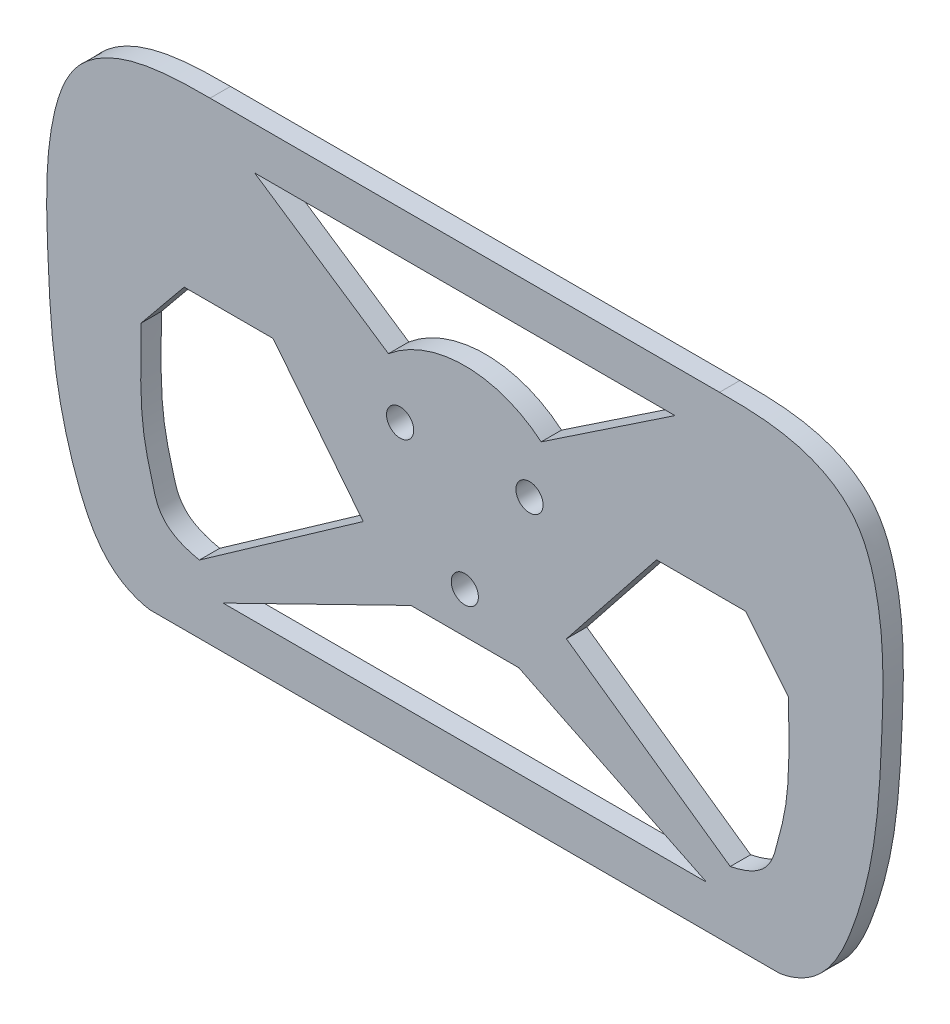
ISO-10303-21;
HEADER;
FILE_DESCRIPTION(('STEP AP214'),'2;1');
FILE_NAME('part.step','',(''),(''),'','','');
FILE_SCHEMA(('AUTOMOTIVE_DESIGN { 1 0 10303 214 1 1 1 1 }'));
ENDSEC;
DATA;
#1=APPLICATION_CONTEXT('core data for automotive mechanical design processes');
#2=APPLICATION_PROTOCOL_DEFINITION('international standard','automotive_design',2000,#1);
#3=PRODUCT_CONTEXT('',#1,'mechanical');
#4=PRODUCT('Part','Part','',(#3));
#5=PRODUCT_RELATED_PRODUCT_CATEGORY('part','',(#4));
#6=PRODUCT_DEFINITION_FORMATION('','',#4);
#7=PRODUCT_DEFINITION_CONTEXT('part definition',#1,'design');
#8=PRODUCT_DEFINITION('design','',#6,#7);
#9=PRODUCT_DEFINITION_SHAPE('','',#8);
#10=(LENGTH_UNIT() NAMED_UNIT(*) SI_UNIT(.MILLI.,.METRE.));
#11=(NAMED_UNIT(*) PLANE_ANGLE_UNIT() SI_UNIT($,.RADIAN.));
#12=(NAMED_UNIT(*) SI_UNIT($,.STERADIAN.) SOLID_ANGLE_UNIT());
#13=UNCERTAINTY_MEASURE_WITH_UNIT(LENGTH_MEASURE(1.E-05),#10,'distance_accuracy_value','');
#14=(GEOMETRIC_REPRESENTATION_CONTEXT(3) GLOBAL_UNCERTAINTY_ASSIGNED_CONTEXT((#13)) GLOBAL_UNIT_ASSIGNED_CONTEXT((#10,
#11,#12)) REPRESENTATION_CONTEXT('',''));
#15=CARTESIAN_POINT('',(0.,0.,0.));
#16=DIRECTION('',(0.,0.,1.));
#17=DIRECTION('',(1.,0.,0.));
#18=AXIS2_PLACEMENT_3D('',#15,#16,#17);
#19=CARTESIAN_POINT('',(0.,65.7259691016847,6.));
#20=DIRECTION('',(0.,1.,0.));
#21=DIRECTION('',(0.,0.,1.));
#22=AXIS2_PLACEMENT_3D('',#19,#20,#21);
#23=PLANE('',#22);
#24=DIRECTION('',(1.,0.,0.));
#25=VECTOR('',#24,1.);
#26=CARTESIAN_POINT('',(0.,65.7259691016847,0.));
#27=LINE('',#26,#25);
#28=CARTESIAN_POINT('',(-75.,65.7259691016847,0.));
#29=VERTEX_POINT('',#28);
#30=CARTESIAN_POINT('',(75.,65.7259691016847,0.));
#31=VERTEX_POINT('',#30);
#32=EDGE_CURVE('E471',#29,#31,#27,.T.);
#33=ORIENTED_EDGE('',*,*,#32,.F.);
#34=DIRECTION('',(0.,0.,-1.));
#35=VECTOR('',#34,1.);
#36=CARTESIAN_POINT('',(-75.,65.7259691016847,6.));
#37=LINE('',#36,#35);
#38=CARTESIAN_POINT('',(-75.,65.7259691016847,6.));
#39=VERTEX_POINT('',#38);
#40=EDGE_CURVE('E11',#39,#29,#37,.T.);
#41=ORIENTED_EDGE('',*,*,#40,.F.);
#42=DIRECTION('',(1.,0.,0.));
#43=VECTOR('',#42,1.);
#44=CARTESIAN_POINT('',(0.,65.7259691016847,6.));
#45=LINE('',#44,#43);
#46=CARTESIAN_POINT('',(75.,65.7259691016847,6.));
#47=VERTEX_POINT('',#46);
#48=EDGE_CURVE('E198',#39,#47,#45,.T.);
#49=ORIENTED_EDGE('',*,*,#48,.T.);
#50=DIRECTION('',(0.,0.,-1.));
#51=VECTOR('',#50,1.);
#52=CARTESIAN_POINT('',(75.,65.7259691016847,6.));
#53=LINE('',#52,#51);
#54=EDGE_CURVE('E54',#47,#31,#53,.T.);
#55=ORIENTED_EDGE('',*,*,#54,.T.);
#56=EDGE_LOOP('',(#33,#41,#49,#55));
#57=FACE_BOUND('',#56,.T.);
#58=ADVANCED_FACE('F35',(#57),#23,.T.);
#59=CARTESIAN_POINT('',(-75.,65.7259691016847,6.));
#60=CARTESIAN_POINT('',(-83.1081901990883,65.7259691016847,6.));
#61=CARTESIAN_POINT('',(-98.0764792531761,65.5654131456338,6.));
#62=CARTESIAN_POINT('',(-116.227458239012,54.9351033241024,6.));
#63=CARTESIAN_POINT('',(-123.782270508209,31.9873900023455,6.));
#64=CARTESIAN_POINT('',(-122.974942530496,4.16927200689115,6.));
#65=CARTESIAN_POINT('',(-121.472955636675,-25.8179218460008,6.));
#66=CARTESIAN_POINT('',(-114.363626194015,-53.8816355469339,6.));
#67=CARTESIAN_POINT('',(-105.22229252136,-71.4115092429265,6.));
#68=CARTESIAN_POINT('',(-92.8418712487192,-73.620070940555,6.));
#69=B_SPLINE_CURVE_WITH_KNOTS('',3,(#59,#60,#61,#62,#63,#64,#65,#66,#67,#68),.UNSPECIFIED.,.F.,
.F.,(4,1,1,1,1,1,1,4),(0.,0.144554348002838,0.228464376945022,0.330263898432636,
0.520750714420918,0.690485280331211,0.822627378586385,1.),.UNSPECIFIED.);
#70=DIRECTION('',(0.,0.,-1.));
#71=VECTOR('',#70,1.);
#72=SURFACE_OF_LINEAR_EXTRUSION('',#69,#71);
#73=CARTESIAN_POINT('',(-75.,65.7259691016847,0.));
#74=CARTESIAN_POINT('',(-83.1081901990883,65.7259691016847,0.));
#75=CARTESIAN_POINT('',(-98.0764792531761,65.5654131456338,0.));
#76=CARTESIAN_POINT('',(-116.227458239012,54.9351033241024,0.));
#77=CARTESIAN_POINT('',(-123.782270508209,31.9873900023455,0.));
#78=CARTESIAN_POINT('',(-122.974942530496,4.16927200689115,0.));
#79=CARTESIAN_POINT('',(-121.472955636675,-25.8179218460008,0.));
#80=CARTESIAN_POINT('',(-114.363626194015,-53.8816355469339,0.));
#81=CARTESIAN_POINT('',(-105.22229252136,-71.4115092429265,0.));
#82=CARTESIAN_POINT('',(-92.8418712487192,-73.620070940555,0.));
#83=B_SPLINE_CURVE_WITH_KNOTS('',3,(#73,#74,#75,#76,#77,#78,#79,#80,#81,#82),.UNSPECIFIED.,.F.,
.F.,(4,1,1,1,1,1,1,4),(0.,0.144554348002838,0.228464376945022,0.330263898432636,
0.520750714420918,0.690485280331211,0.822627378586385,1.),.UNSPECIFIED.);
#84=CARTESIAN_POINT('',(-92.8418712487192,-73.620070940555,0.));
#85=VERTEX_POINT('',#84);
#86=EDGE_CURVE('E204',#29,#85,#83,.T.);
#87=ORIENTED_EDGE('',*,*,#86,.T.);
#88=DIRECTION('',(0.,0.,-1.));
#89=VECTOR('',#88,1.);
#90=CARTESIAN_POINT('',(-92.8418712487192,-73.620070940555,6.));
#91=LINE('',#90,#89);
#92=CARTESIAN_POINT('',(-92.8418712487192,-73.620070940555,6.));
#93=VERTEX_POINT('',#92);
#94=EDGE_CURVE('E45',#93,#85,#91,.T.);
#95=ORIENTED_EDGE('',*,*,#94,.F.);
#96=EDGE_CURVE('E192',#39,#93,#69,.T.);
#97=ORIENTED_EDGE('',*,*,#96,.F.);
#98=ORIENTED_EDGE('',*,*,#40,.T.);
#99=EDGE_LOOP('',(#87,#95,#97,#98));
#100=FACE_BOUND('',#99,.T.);
#101=ADVANCED_FACE('F202',(#100),#72,.F.);
#102=CARTESIAN_POINT('',(0.,-73.620070940555,6.));
#103=DIRECTION('',(0.,-1.,0.));
#104=DIRECTION('',(0.,0.,-1.));
#105=AXIS2_PLACEMENT_3D('',#102,#103,#104);
#106=PLANE('',#105);
#107=DIRECTION('',(-1.,0.,0.));
#108=VECTOR('',#107,1.);
#109=CARTESIAN_POINT('',(0.,-73.620070940555,0.));
#110=LINE('',#109,#108);
#111=CARTESIAN_POINT('',(92.8418712487192,-73.620070940555,0.));
#112=VERTEX_POINT('',#111);
#113=EDGE_CURVE('E339',#112,#85,#110,.T.);
#114=ORIENTED_EDGE('',*,*,#113,.F.);
#115=DIRECTION('',(0.,0.,-1.));
#116=VECTOR('',#115,1.);
#117=CARTESIAN_POINT('',(92.8418712487192,-73.620070940555,6.));
#118=LINE('',#117,#116);
#119=CARTESIAN_POINT('',(92.8418712487192,-73.620070940555,6.));
#120=VERTEX_POINT('',#119);
#121=EDGE_CURVE('E121',#120,#112,#118,.T.);
#122=ORIENTED_EDGE('',*,*,#121,.F.);
#123=DIRECTION('',(-1.,0.,0.));
#124=VECTOR('',#123,1.);
#125=CARTESIAN_POINT('',(0.,-73.620070940555,6.));
#126=LINE('',#125,#124);
#127=EDGE_CURVE('E197',#120,#93,#126,.T.);
#128=ORIENTED_EDGE('',*,*,#127,.T.);
#129=ORIENTED_EDGE('',*,*,#94,.T.);
#130=EDGE_LOOP('',(#114,#122,#128,#129));
#131=FACE_BOUND('',#130,.T.);
#132=ADVANCED_FACE('F208',(#131),#106,.T.);
#133=CARTESIAN_POINT('',(10.3833957913881,-21.2268138470578,6.));
#134=DIRECTION('',(0.439409666933636,-0.898286783051644,0.));
#135=DIRECTION('',(0.898286783051644,0.439409666933636,0.));
#136=AXIS2_PLACEMENT_3D('',#133,#134,#135);
#137=PLANE('',#136);
#138=DIRECTION('',(-0.898286783051644,-0.439409666933636,0.));
#139=VECTOR('',#138,1.);
#140=CARTESIAN_POINT('',(10.3833957913881,-21.2268138470578,0.));
#141=LINE('',#140,#139);
#142=CARTESIAN_POINT('',(-15.8757353781866,-34.0718387309718,0.));
#143=VERTEX_POINT('',#142);
#144=CARTESIAN_POINT('',(-71.1705350313991,-61.120070940555,0.));
#145=VERTEX_POINT('',#144);
#146=EDGE_CURVE('E450',#143,#145,#141,.T.);
#147=ORIENTED_EDGE('',*,*,#146,.F.);
#148=DIRECTION('',(0.,0.,-1.));
#149=VECTOR('',#148,1.);
#150=CARTESIAN_POINT('',(-15.8757353781866,-34.0718387309718,6.));
#151=LINE('',#150,#149);
#152=CARTESIAN_POINT('',(-15.8757353781866,-34.0718387309718,6.));
#153=VERTEX_POINT('',#152);
#154=EDGE_CURVE('E352',#153,#143,#151,.T.);
#155=ORIENTED_EDGE('',*,*,#154,.F.);
#156=DIRECTION('',(-0.898286783051644,-0.439409666933636,0.));
#157=VECTOR('',#156,1.);
#158=CARTESIAN_POINT('',(10.3833957913881,-21.2268138470578,6.));
#159=LINE('',#158,#157);
#160=CARTESIAN_POINT('',(-71.1705350313991,-61.120070940555,6.));
#161=VERTEX_POINT('',#160);
#162=EDGE_CURVE('E316',#153,#161,#159,.T.);
#163=ORIENTED_EDGE('',*,*,#162,.T.);
#164=DIRECTION('',(0.,0.,-1.));
#165=VECTOR('',#164,1.);
#166=CARTESIAN_POINT('',(-71.1705350313991,-61.120070940555,6.));
#167=LINE('',#166,#165);
#168=EDGE_CURVE('E354',#161,#145,#167,.T.);
#169=ORIENTED_EDGE('',*,*,#168,.T.);
#170=EDGE_LOOP('',(#147,#155,#163,#169));
#171=FACE_BOUND('',#170,.T.);
#172=ADVANCED_FACE('F236',(#171),#137,.T.);
#173=CARTESIAN_POINT('',(0.,-34.0718387309718,6.));
#174=DIRECTION('',(0.,1.,0.));
#175=DIRECTION('',(0.,0.,1.));
#176=AXIS2_PLACEMENT_3D('',#173,#174,#175);
#177=PLANE('',#176);
#178=DIRECTION('',(1.,0.,0.));
#179=VECTOR('',#178,1.);
#180=CARTESIAN_POINT('',(0.,-34.0718387309718,0.));
#181=LINE('',#180,#179);
#182=CARTESIAN_POINT('',(15.8757353781866,-34.0718387309718,0.));
#183=VERTEX_POINT('',#182);
#184=EDGE_CURVE('E453',#143,#183,#181,.T.);
#185=ORIENTED_EDGE('',*,*,#184,.T.);
#186=DIRECTION('',(0.,0.,-1.));
#187=VECTOR('',#186,1.);
#188=CARTESIAN_POINT('',(15.8757353781866,-34.0718387309718,6.));
#189=LINE('',#188,#187);
#190=CARTESIAN_POINT('',(15.8757353781866,-34.0718387309718,6.));
#191=VERTEX_POINT('',#190);
#192=EDGE_CURVE('E360',#191,#183,#189,.T.);
#193=ORIENTED_EDGE('',*,*,#192,.F.);
#194=DIRECTION('',(1.,0.,0.));
#195=VECTOR('',#194,1.);
#196=CARTESIAN_POINT('',(0.,-34.0718387309718,6.));
#197=LINE('',#196,#195);
#198=EDGE_CURVE('E319',#153,#191,#197,.T.);
#199=ORIENTED_EDGE('',*,*,#198,.F.);
#200=ORIENTED_EDGE('',*,*,#154,.T.);
#201=EDGE_LOOP('',(#185,#193,#199,#200));
#202=FACE_BOUND('',#201,.T.);
#203=ADVANCED_FACE('F263',(#202),#177,.F.);
#204=CARTESIAN_POINT('',(-10.3833957913881,-21.2268138470578,6.));
#205=DIRECTION('',(0.439409666933636,0.898286783051644,0.));
#206=DIRECTION('',(-0.898286783051644,0.439409666933636,0.));
#207=AXIS2_PLACEMENT_3D('',#204,#205,#206);
#208=PLANE('',#207);
#209=DIRECTION('',(0.898286783051644,-0.439409666933636,0.));
#210=VECTOR('',#209,1.);
#211=CARTESIAN_POINT('',(-10.3833957913881,-21.2268138470578,0.));
#212=LINE('',#211,#210);
#213=CARTESIAN_POINT('',(71.1705350313991,-61.120070940555,0.));
#214=VERTEX_POINT('',#213);
#215=EDGE_CURVE('E456',#183,#214,#212,.T.);
#216=ORIENTED_EDGE('',*,*,#215,.T.);
#217=DIRECTION('',(0.,0.,-1.));
#218=VECTOR('',#217,1.);
#219=CARTESIAN_POINT('',(71.1705350313991,-61.120070940555,6.));
#220=LINE('',#219,#218);
#221=CARTESIAN_POINT('',(71.1705350313991,-61.120070940555,6.));
#222=VERTEX_POINT('',#221);
#223=EDGE_CURVE('E356',#222,#214,#220,.T.);
#224=ORIENTED_EDGE('',*,*,#223,.F.);
#225=DIRECTION('',(0.898286783051644,-0.439409666933636,0.));
#226=VECTOR('',#225,1.);
#227=CARTESIAN_POINT('',(-10.3833957913881,-21.2268138470578,6.));
#228=LINE('',#227,#226);
#229=EDGE_CURVE('E322',#191,#222,#228,.T.);
#230=ORIENTED_EDGE('',*,*,#229,.F.);
#231=ORIENTED_EDGE('',*,*,#192,.T.);
#232=EDGE_LOOP('',(#216,#224,#230,#231));
#233=FACE_BOUND('',#232,.T.);
#234=ADVANCED_FACE('F259',(#233),#208,.F.);
#235=CARTESIAN_POINT('',(-5.43677896468764,8.11448468911986,6.));
#236=DIRECTION('',(-0.556621129897083,0.830766464027102,0.));
#237=DIRECTION('',(-0.830766464027102,-0.556621129897084,0.));
#238=AXIS2_PLACEMENT_3D('',#235,#236,#237);
#239=PLANE('',#238);
#240=DIRECTION('',(0.830766464027102,0.556621129897084,0.));
#241=VECTOR('',#240,1.);
#242=CARTESIAN_POINT('',(-5.43677896468764,8.11448468911986,0.));
#243=LINE('',#242,#241);
#244=CARTESIAN_POINT('',(22.4848428090624,26.82222667587,0.));
#245=VERTEX_POINT('',#244);
#246=CARTESIAN_POINT('',(61.8928755875381,53.2259691016847,0.));
#247=VERTEX_POINT('',#246);
#248=EDGE_CURVE('E435',#245,#247,#243,.T.);
#249=ORIENTED_EDGE('',*,*,#248,.F.);
#250=DIRECTION('',(0.,0.,-1.));
#251=VECTOR('',#250,1.);
#252=CARTESIAN_POINT('',(22.4848428090624,26.82222667587,6.));
#253=LINE('',#252,#251);
#254=CARTESIAN_POINT('',(22.4848428090624,26.82222667587,6.));
#255=VERTEX_POINT('',#254);
#256=EDGE_CURVE('E357',#255,#245,#253,.T.);
#257=ORIENTED_EDGE('',*,*,#256,.F.);
#258=DIRECTION('',(0.830766464027102,0.556621129897084,0.));
#259=VECTOR('',#258,1.);
#260=CARTESIAN_POINT('',(-5.43677896468764,8.11448468911986,6.));
#261=LINE('',#260,#259);
#262=CARTESIAN_POINT('',(61.8928755875381,53.2259691016847,6.));
#263=VERTEX_POINT('',#262);
#264=EDGE_CURVE('E300',#255,#263,#261,.T.);
#265=ORIENTED_EDGE('',*,*,#264,.T.);
#266=DIRECTION('',(0.,0.,-1.));
#267=VECTOR('',#266,1.);
#268=CARTESIAN_POINT('',(61.8928755875381,53.2259691016847,6.));
#269=LINE('',#268,#267);
#270=EDGE_CURVE('E364',#263,#247,#269,.T.);
#271=ORIENTED_EDGE('',*,*,#270,.T.);
#272=EDGE_LOOP('',(#249,#257,#265,#271));
#273=FACE_BOUND('',#272,.T.);
#274=ADVANCED_FACE('F262',(#273),#239,.T.);
#275=CARTESIAN_POINT('',(0.,0.,6.));
#276=DIRECTION('',(0.,0.,-1.));
#277=DIRECTION('',(-1.,0.,0.));
#278=AXIS2_PLACEMENT_3D('',#275,#276,#277);
#279=CYLINDRICAL_SURFACE('',#278,35.);
#280=CARTESIAN_POINT('',(0.,0.,0.));
#281=DIRECTION('',(0.,0.,1.));
#282=DIRECTION('',(1.,0.,0.));
#283=AXIS2_PLACEMENT_3D('',#280,#281,#282);
#284=CIRCLE('',#283,35.);
#285=CARTESIAN_POINT('',(-22.4848428090624,26.82222667587,0.));
#286=VERTEX_POINT('',#285);
#287=EDGE_CURVE('E441',#245,#286,#284,.T.);
#288=ORIENTED_EDGE('',*,*,#287,.T.);
#289=DIRECTION('',(0.,0.,-1.));
#290=VECTOR('',#289,1.);
#291=CARTESIAN_POINT('',(-22.4848428090624,26.82222667587,6.));
#292=LINE('',#291,#290);
#293=CARTESIAN_POINT('',(-22.4848428090624,26.82222667587,6.));
#294=VERTEX_POINT('',#293);
#295=EDGE_CURVE('E369',#294,#286,#292,.T.);
#296=ORIENTED_EDGE('',*,*,#295,.F.);
#297=CARTESIAN_POINT('',(0.,0.,6.));
#298=DIRECTION('',(0.,0.,1.));
#299=DIRECTION('',(1.,0.,0.));
#300=AXIS2_PLACEMENT_3D('',#297,#298,#299);
#301=CIRCLE('',#300,35.);
#302=EDGE_CURVE('E308',#255,#294,#301,.T.);
#303=ORIENTED_EDGE('',*,*,#302,.F.);
#304=ORIENTED_EDGE('',*,*,#256,.T.);
#305=EDGE_LOOP('',(#288,#296,#303,#304));
#306=FACE_BOUND('',#305,.T.);
#307=ADVANCED_FACE('F279',(#306),#279,.T.);
#308=CARTESIAN_POINT('',(5.43677896468764,8.11448468911986,6.));
#309=DIRECTION('',(-0.556621129897083,-0.830766464027102,0.));
#310=DIRECTION('',(0.830766464027102,-0.556621129897084,0.));
#311=AXIS2_PLACEMENT_3D('',#308,#309,#310);
#312=PLANE('',#311);
#313=DIRECTION('',(-0.830766464027102,0.556621129897084,0.));
#314=VECTOR('',#313,1.);
#315=CARTESIAN_POINT('',(5.43677896468764,8.11448468911986,0.));
#316=LINE('',#315,#314);
#317=CARTESIAN_POINT('',(-61.8928755875381,53.2259691016847,0.));
#318=VERTEX_POINT('',#317);
#319=EDGE_CURVE('E444',#286,#318,#316,.T.);
#320=ORIENTED_EDGE('',*,*,#319,.T.);
#321=DIRECTION('',(0.,0.,-1.));
#322=VECTOR('',#321,1.);
#323=CARTESIAN_POINT('',(-61.8928755875381,53.2259691016847,6.));
#324=LINE('',#323,#322);
#325=CARTESIAN_POINT('',(-61.8928755875381,53.2259691016847,6.));
#326=VERTEX_POINT('',#325);
#327=EDGE_CURVE('E366',#326,#318,#324,.T.);
#328=ORIENTED_EDGE('',*,*,#327,.F.);
#329=DIRECTION('',(-0.830766464027102,0.556621129897084,0.));
#330=VECTOR('',#329,1.);
#331=CARTESIAN_POINT('',(5.43677896468764,8.11448468911986,6.));
#332=LINE('',#331,#330);
#333=EDGE_CURVE('E311',#294,#326,#332,.T.);
#334=ORIENTED_EDGE('',*,*,#333,.F.);
#335=ORIENTED_EDGE('',*,*,#295,.T.);
#336=EDGE_LOOP('',(#320,#328,#334,#335));
#337=FACE_BOUND('',#336,.T.);
#338=ADVANCED_FACE('F275',(#337),#312,.F.);
#339=CARTESIAN_POINT('',(-56.303101597978,45.9787952139932,6.));
#340=DIRECTION('',(0.77454608586857,-0.632517478703694,0.));
#341=DIRECTION('',(0.632517478703694,0.77454608586857,0.));
#342=AXIS2_PLACEMENT_3D('',#339,#340,#341);
#343=PLANE('',#342);
#344=DIRECTION('',(-0.632517478703694,-0.77454608586857,0.));
#345=VECTOR('',#344,1.);
#346=CARTESIAN_POINT('',(-56.303101597978,45.9787952139932,0.));
#347=LINE('',#346,#345);
#348=CARTESIAN_POINT('',(-82.6455031804008,13.7213403214278,0.));
#349=VERTEX_POINT('',#348);
#350=CARTESIAN_POINT('',(-95.3562487472723,-1.84353900407075,0.));
#351=VERTEX_POINT('',#350);
#352=EDGE_CURVE('E413',#349,#351,#347,.T.);
#353=ORIENTED_EDGE('',*,*,#352,.F.);
#354=DIRECTION('',(0.,0.,-1.));
#355=VECTOR('',#354,1.);
#356=CARTESIAN_POINT('',(-82.6455031804008,13.7213403214278,6.));
#357=LINE('',#356,#355);
#358=CARTESIAN_POINT('',(-82.6455031804008,13.7213403214278,6.));
#359=VERTEX_POINT('',#358);
#360=EDGE_CURVE('E367',#359,#349,#357,.T.);
#361=ORIENTED_EDGE('',*,*,#360,.F.);
#362=DIRECTION('',(-0.632517478703694,-0.77454608586857,0.));
#363=VECTOR('',#362,1.);
#364=CARTESIAN_POINT('',(-56.303101597978,45.9787952139932,6.));
#365=LINE('',#364,#363);
#366=CARTESIAN_POINT('',(-95.3562487472723,-1.84353900407075,6.));
#367=VERTEX_POINT('',#366);
#368=EDGE_CURVE('E490',#359,#367,#365,.T.);
#369=ORIENTED_EDGE('',*,*,#368,.T.);
#370=DIRECTION('',(0.,0.,-1.));
#371=VECTOR('',#370,1.);
#372=CARTESIAN_POINT('',(-95.3562487472723,-1.84353900407075,6.));
#373=LINE('',#372,#371);
#374=EDGE_CURVE('E373',#367,#351,#373,.T.);
#375=ORIENTED_EDGE('',*,*,#374,.T.);
#376=EDGE_LOOP('',(#353,#361,#369,#375));
#377=FACE_BOUND('',#376,.T.);
#378=ADVANCED_FACE('F278',(#377),#343,.T.);
#379=CARTESIAN_POINT('',(0.,13.7213403214278,6.));
#380=DIRECTION('',(0.,1.,0.));
#381=DIRECTION('',(0.,0.,1.));
#382=AXIS2_PLACEMENT_3D('',#379,#380,#381);
#383=PLANE('',#382);
#384=DIRECTION('',(1.,0.,0.));
#385=VECTOR('',#384,1.);
#386=CARTESIAN_POINT('',(0.,13.7213403214278,0.));
#387=LINE('',#386,#385);
#388=CARTESIAN_POINT('',(-56.4566771112309,13.7213403214278,0.));
#389=VERTEX_POINT('',#388);
#390=EDGE_CURVE('E417',#349,#389,#387,.T.);
#391=ORIENTED_EDGE('',*,*,#390,.T.);
#392=DIRECTION('',(0.,0.,-1.));
#393=VECTOR('',#392,1.);
#394=CARTESIAN_POINT('',(-56.4566771112309,13.7213403214278,6.));
#395=LINE('',#394,#393);
#396=CARTESIAN_POINT('',(-56.4566771112309,13.7213403214278,6.));
#397=VERTEX_POINT('',#396);
#398=EDGE_CURVE('E379',#397,#389,#395,.T.);
#399=ORIENTED_EDGE('',*,*,#398,.F.);
#400=DIRECTION('',(1.,0.,0.));
#401=VECTOR('',#400,1.);
#402=CARTESIAN_POINT('',(0.,13.7213403214278,6.));
#403=LINE('',#402,#401);
#404=EDGE_CURVE('E525',#359,#397,#403,.T.);
#405=ORIENTED_EDGE('',*,*,#404,.F.);
#406=ORIENTED_EDGE('',*,*,#360,.T.);
#407=EDGE_LOOP('',(#391,#399,#405,#406));
#408=FACE_BOUND('',#407,.T.);
#409=ADVANCED_FACE('F543',(#408),#383,.F.);
#410=CARTESIAN_POINT('',(-27.9319950047156,-22.1879110983492,6.));
#411=DIRECTION('',(0.783020448760755,0.621995962062862,0.));
#412=DIRECTION('',(-0.621995962062862,0.783020448760755,0.));
#413=AXIS2_PLACEMENT_3D('',#410,#411,#412);
#414=PLANE('',#413);
#415=DIRECTION('',(0.621995962062862,-0.783020448760755,0.));
#416=VECTOR('',#415,1.);
#417=CARTESIAN_POINT('',(-27.9319950047156,-22.1879110983492,0.));
#418=LINE('',#417,#416);
#419=CARTESIAN_POINT('',(-29.9134074545485,-19.6935436743185,0.));
#420=VERTEX_POINT('',#419);
#421=EDGE_CURVE('E424',#389,#420,#418,.T.);
#422=ORIENTED_EDGE('',*,*,#421,.T.);
#423=DIRECTION('',(0.,0.,-1.));
#424=VECTOR('',#423,1.);
#425=CARTESIAN_POINT('',(-29.9134074545485,-19.6935436743185,6.));
#426=LINE('',#425,#424);
#427=CARTESIAN_POINT('',(-29.9134074545485,-19.6935436743185,6.));
#428=VERTEX_POINT('',#427);
#429=EDGE_CURVE('E377',#428,#420,#426,.T.);
#430=ORIENTED_EDGE('',*,*,#429,.F.);
#431=DIRECTION('',(0.621995962062862,-0.783020448760755,0.));
#432=VECTOR('',#431,1.);
#433=CARTESIAN_POINT('',(-27.9319950047156,-22.1879110983492,6.));
#434=LINE('',#433,#432);
#435=EDGE_CURVE('E530',#397,#428,#434,.T.);
#436=ORIENTED_EDGE('',*,*,#435,.F.);
#437=ORIENTED_EDGE('',*,*,#398,.T.);
#438=EDGE_LOOP('',(#422,#430,#436,#437));
#439=FACE_BOUND('',#438,.T.);
#440=ADVANCED_FACE('F545',(#439),#414,.F.);
#441=CARTESIAN_POINT('',(-0.63517585613574,0.902913806371671,6.));
#442=DIRECTION('',(-0.575367426526564,0.817895057138872,0.));
#443=DIRECTION('',(-0.817895057138872,-0.575367426526564,0.));
#444=AXIS2_PLACEMENT_3D('',#441,#442,#443);
#445=PLANE('',#444);
#446=DIRECTION('',(0.817895057138872,0.575367426526564,0.));
#447=VECTOR('',#446,1.);
#448=CARTESIAN_POINT('',(-0.63517585613574,0.902913806371671,0.));
#449=LINE('',#448,#447);
#450=CARTESIAN_POINT('',(-78.1548784599622,-53.6301358837612,0.));
#451=VERTEX_POINT('',#450);
#452=EDGE_CURVE('E427',#451,#420,#449,.T.);
#453=ORIENTED_EDGE('',*,*,#452,.F.);
#454=DIRECTION('',(0.,0.,-1.));
#455=VECTOR('',#454,1.);
#456=CARTESIAN_POINT('',(-78.1548784599622,-53.6301358837612,6.));
#457=LINE('',#456,#455);
#458=CARTESIAN_POINT('',(-78.1548784599622,-53.6301358837612,6.));
#459=VERTEX_POINT('',#458);
#460=EDGE_CURVE('E375',#459,#451,#457,.T.);
#461=ORIENTED_EDGE('',*,*,#460,.F.);
#462=DIRECTION('',(0.817895057138872,0.575367426526564,0.));
#463=VECTOR('',#462,1.);
#464=CARTESIAN_POINT('',(-0.63517585613574,0.902913806371671,6.));
#465=LINE('',#464,#463);
#466=EDGE_CURVE('E301',#459,#428,#465,.T.);
#467=ORIENTED_EDGE('',*,*,#466,.T.);
#468=ORIENTED_EDGE('',*,*,#429,.T.);
#469=EDGE_LOOP('',(#453,#461,#467,#468));
#470=FACE_BOUND('',#469,.T.);
#471=ADVANCED_FACE('F291',(#470),#445,.T.);
#472=CARTESIAN_POINT('',(0.,13.7213403214278,6.));
#473=DIRECTION('',(0.,-1.,0.));
#474=DIRECTION('',(0.,0.,-1.));
#475=AXIS2_PLACEMENT_3D('',#472,#473,#474);
#476=PLANE('',#475);
#477=DIRECTION('',(-1.,0.,0.));
#478=VECTOR('',#477,1.);
#479=CARTESIAN_POINT('',(0.,13.7213403214278,0.));
#480=LINE('',#479,#478);
#481=CARTESIAN_POINT('',(82.6455031804008,13.7213403214278,0.));
#482=VERTEX_POINT('',#481);
#483=CARTESIAN_POINT('',(56.4566771112322,13.7213403214278,0.));
#484=VERTEX_POINT('',#483);
#485=EDGE_CURVE('E221',#482,#484,#480,.T.);
#486=ORIENTED_EDGE('',*,*,#485,.F.);
#487=DIRECTION('',(0.,0.,-1.));
#488=VECTOR('',#487,1.);
#489=CARTESIAN_POINT('',(82.6455031804008,13.7213403214278,6.));
#490=LINE('',#489,#488);
#491=CARTESIAN_POINT('',(82.6455031804008,13.7213403214278,6.));
#492=VERTEX_POINT('',#491);
#493=EDGE_CURVE('E39',#492,#482,#490,.T.);
#494=ORIENTED_EDGE('',*,*,#493,.F.);
#495=DIRECTION('',(-1.,0.,0.));
#496=VECTOR('',#495,1.);
#497=CARTESIAN_POINT('',(0.,13.7213403214278,6.));
#498=LINE('',#497,#496);
#499=CARTESIAN_POINT('',(56.4566771112322,13.7213403214278,6.));
#500=VERTEX_POINT('',#499);
#501=EDGE_CURVE('E338',#492,#500,#498,.T.);
#502=ORIENTED_EDGE('',*,*,#501,.T.);
#503=DIRECTION('',(0.,0.,-1.));
#504=VECTOR('',#503,1.);
#505=CARTESIAN_POINT('',(56.4566771112322,13.7213403214278,6.));
#506=LINE('',#505,#504);
#507=EDGE_CURVE('E211',#500,#484,#506,.T.);
#508=ORIENTED_EDGE('',*,*,#507,.T.);
#509=EDGE_LOOP('',(#486,#494,#502,#508));
#510=FACE_BOUND('',#509,.T.);
#511=ADVANCED_FACE('F37',(#510),#476,.T.);
#512=CARTESIAN_POINT('',(56.303101597978,45.9787952139932,6.));
#513=DIRECTION('',(0.77454608586857,0.632517478703694,0.));
#514=DIRECTION('',(-0.632517478703694,0.77454608586857,0.));
#515=AXIS2_PLACEMENT_3D('',#512,#513,#514);
#516=PLANE('',#515);
#517=DIRECTION('',(0.632517478703694,-0.77454608586857,0.));
#518=VECTOR('',#517,1.);
#519=CARTESIAN_POINT('',(56.303101597978,45.9787952139932,0.));
#520=LINE('',#519,#518);
#521=CARTESIAN_POINT('',(95.3562487472723,-1.84353900407075,0.));
#522=VERTEX_POINT('',#521);
#523=EDGE_CURVE('E397',#482,#522,#520,.T.);
#524=ORIENTED_EDGE('',*,*,#523,.T.);
#525=DIRECTION('',(0.,0.,-1.));
#526=VECTOR('',#525,1.);
#527=CARTESIAN_POINT('',(95.3562487472723,-1.84353900407075,6.));
#528=LINE('',#527,#526);
#529=CARTESIAN_POINT('',(95.3562487472723,-1.84353900407075,6.));
#530=VERTEX_POINT('',#529);
#531=EDGE_CURVE('E388',#530,#522,#528,.T.);
#532=ORIENTED_EDGE('',*,*,#531,.F.);
#533=DIRECTION('',(0.632517478703694,-0.77454608586857,0.));
#534=VECTOR('',#533,1.);
#535=CARTESIAN_POINT('',(56.303101597978,45.9787952139932,6.));
#536=LINE('',#535,#534);
#537=EDGE_CURVE('E341',#492,#530,#536,.T.);
#538=ORIENTED_EDGE('',*,*,#537,.F.);
#539=ORIENTED_EDGE('',*,*,#493,.T.);
#540=EDGE_LOOP('',(#524,#532,#538,#539));
#541=FACE_BOUND('',#540,.T.);
#542=ADVANCED_FACE('F396',(#541),#516,.F.);
#543=CARTESIAN_POINT('',(95.3562487472723,-1.84353900407075,6.));
#544=CARTESIAN_POINT('',(95.5576119241805,-16.5591311422923,6.));
#545=CARTESIAN_POINT('',(95.6059644943259,-27.3437599471163,6.));
#546=CARTESIAN_POINT('',(91.3093785118904,-43.453128681603,6.));
#547=CARTESIAN_POINT('',(89.2122977179003,-51.3575867050179,6.));
#548=CARTESIAN_POINT('',(78.1548784599622,-53.6301358837612,6.));
#549=B_SPLINE_CURVE_WITH_KNOTS('',3,(#543,#544,#545,#546,#547,#548),.UNSPECIFIED.,.F.,.F.,(4,1,
1,4),(0.,0.501052943579188,0.678150100172681,1.),.UNSPECIFIED.);
#550=DIRECTION('',(0.,0.,-1.));
#551=VECTOR('',#550,1.);
#552=SURFACE_OF_LINEAR_EXTRUSION('',#549,#551);
#553=CARTESIAN_POINT('',(95.3562487472723,-1.84353900407075,0.));
#554=CARTESIAN_POINT('',(95.5576119241805,-16.5591311422923,0.));
#555=CARTESIAN_POINT('',(95.6059644943259,-27.3437599471163,0.));
#556=CARTESIAN_POINT('',(91.3093785118904,-43.453128681603,0.));
#557=CARTESIAN_POINT('',(89.2122977179003,-51.3575867050179,0.));
#558=CARTESIAN_POINT('',(78.1548784599622,-53.6301358837612,0.));
#559=B_SPLINE_CURVE_WITH_KNOTS('',3,(#553,#554,#555,#556,#557,#558),.UNSPECIFIED.,.F.,.F.,(4,1,
1,4),(0.,0.501052943579188,0.678150100172681,1.),.UNSPECIFIED.);
#560=CARTESIAN_POINT('',(78.1548784599622,-53.6301358837612,0.));
#561=VERTEX_POINT('',#560);
#562=EDGE_CURVE('E405',#522,#561,#559,.T.);
#563=ORIENTED_EDGE('',*,*,#562,.T.);
#564=DIRECTION('',(0.,0.,-1.));
#565=VECTOR('',#564,1.);
#566=CARTESIAN_POINT('',(78.1548784599622,-53.6301358837612,6.));
#567=LINE('',#566,#565);
#568=CARTESIAN_POINT('',(78.1548784599622,-53.6301358837612,6.));
#569=VERTEX_POINT('',#568);
#570=EDGE_CURVE('E386',#569,#561,#567,.T.);
#571=ORIENTED_EDGE('',*,*,#570,.F.);
#572=EDGE_CURVE('E563',#530,#569,#549,.T.);
#573=ORIENTED_EDGE('',*,*,#572,.F.);
#574=ORIENTED_EDGE('',*,*,#531,.T.);
#575=EDGE_LOOP('',(#563,#571,#573,#574));
#576=FACE_BOUND('',#575,.T.);
#577=ADVANCED_FACE('F559',(#576),#552,.F.);
#578=CARTESIAN_POINT('',(0.63517585613574,0.902913806371671,6.));
#579=DIRECTION('',(-0.575367426526564,-0.817895057138872,0.));
#580=DIRECTION('',(0.817895057138872,-0.575367426526564,0.));
#581=AXIS2_PLACEMENT_3D('',#578,#579,#580);
#582=PLANE('',#581);
#583=DIRECTION('',(-0.817895057138872,0.575367426526564,0.));
#584=VECTOR('',#583,1.);
#585=CARTESIAN_POINT('',(0.63517585613574,0.902913806371671,0.));
#586=LINE('',#585,#584);
#587=CARTESIAN_POINT('',(29.9134074545485,-19.6935436743185,0.));
#588=VERTEX_POINT('',#587);
#589=EDGE_CURVE('E414',#561,#588,#586,.T.);
#590=ORIENTED_EDGE('',*,*,#589,.T.);
#591=DIRECTION('',(0.,0.,-1.));
#592=VECTOR('',#591,1.);
#593=CARTESIAN_POINT('',(29.9134074545485,-19.6935436743185,6.));
#594=LINE('',#593,#592);
#595=CARTESIAN_POINT('',(29.9134074545485,-19.6935436743185,6.));
#596=VERTEX_POINT('',#595);
#597=EDGE_CURVE('E384',#596,#588,#594,.T.);
#598=ORIENTED_EDGE('',*,*,#597,.F.);
#599=DIRECTION('',(-0.817895057138872,0.575367426526564,0.));
#600=VECTOR('',#599,1.);
#601=CARTESIAN_POINT('',(0.63517585613574,0.902913806371671,6.));
#602=LINE('',#601,#600);
#603=EDGE_CURVE('E532',#569,#596,#602,.T.);
#604=ORIENTED_EDGE('',*,*,#603,.F.);
#605=ORIENTED_EDGE('',*,*,#570,.T.);
#606=EDGE_LOOP('',(#590,#598,#604,#605));
#607=FACE_BOUND('',#606,.T.);
#608=ADVANCED_FACE('F245',(#607),#582,.F.);
#609=CARTESIAN_POINT('',(0.,-21.9970452561248,6.));
#610=DIRECTION('',(0.,0.,-1.));
#611=DIRECTION('',(-1.,0.,0.));
#612=AXIS2_PLACEMENT_3D('',#609,#610,#611);
#613=CYLINDRICAL_SURFACE('',#612,4.);
#614=CARTESIAN_POINT('',(0.,-21.9970452561248,6.));
#615=DIRECTION('',(0.,0.,1.));
#616=DIRECTION('',(1.,0.,0.));
#617=AXIS2_PLACEMENT_3D('',#614,#615,#616);
#618=CIRCLE('',#617,4.);
#619=CARTESIAN_POINT('',(4.,-21.9970452561248,6.));
#620=VERTEX_POINT('',#619);
#621=EDGE_CURVE('E333',#620,#620,#618,.T.);
#622=ORIENTED_EDGE('',*,*,#621,.T.);
#623=EDGE_LOOP('',(#622));
#624=FACE_BOUND('',#623,.T.);
#625=CARTESIAN_POINT('',(0.,-21.9970452561248,0.));
#626=DIRECTION('',(0.,0.,1.));
#627=DIRECTION('',(1.,0.,0.));
#628=AXIS2_PLACEMENT_3D('',#625,#626,#627);
#629=CIRCLE('',#628,4.);
#630=CARTESIAN_POINT('',(4.,-21.9970452561248,0.));
#631=VERTEX_POINT('',#630);
#632=EDGE_CURVE('E468',#631,#631,#629,.T.);
#633=ORIENTED_EDGE('',*,*,#632,.F.);
#634=EDGE_LOOP('',(#633));
#635=FACE_BOUND('',#634,.T.);
#636=ADVANCED_FACE('F241',(#624,#635),#613,.F.);
#637=CARTESIAN_POINT('',(19.05,10.9985226280624,6.));
#638=DIRECTION('',(0.,0.,-1.));
#639=DIRECTION('',(-1.,0.,0.));
#640=AXIS2_PLACEMENT_3D('',#637,#638,#639);
#641=CYLINDRICAL_SURFACE('',#640,4.);
#642=CARTESIAN_POINT('',(19.05,10.9985226280624,6.));
#643=DIRECTION('',(0.,0.,1.));
#644=DIRECTION('',(1.,0.,0.));
#645=AXIS2_PLACEMENT_3D('',#642,#643,#644);
#646=CIRCLE('',#645,4.);
#647=CARTESIAN_POINT('',(23.05,10.9985226280624,6.));
#648=VERTEX_POINT('',#647);
#649=EDGE_CURVE('E330',#648,#648,#646,.T.);
#650=ORIENTED_EDGE('',*,*,#649,.T.);
#651=EDGE_LOOP('',(#650));
#652=FACE_BOUND('',#651,.T.);
#653=CARTESIAN_POINT('',(19.05,10.9985226280624,0.));
#654=DIRECTION('',(0.,0.,1.));
#655=DIRECTION('',(1.,0.,0.));
#656=AXIS2_PLACEMENT_3D('',#653,#654,#655);
#657=CIRCLE('',#656,4.);
#658=CARTESIAN_POINT('',(23.05,10.9985226280624,0.));
#659=VERTEX_POINT('',#658);
#660=EDGE_CURVE('E465',#659,#659,#657,.T.);
#661=ORIENTED_EDGE('',*,*,#660,.F.);
#662=EDGE_LOOP('',(#661));
#663=FACE_BOUND('',#662,.T.);
#664=ADVANCED_FACE('F244',(#652,#663),#641,.F.);
#665=CARTESIAN_POINT('',(-19.05,10.9985226280624,6.));
#666=DIRECTION('',(0.,0.,-1.));
#667=DIRECTION('',(-1.,0.,0.));
#668=AXIS2_PLACEMENT_3D('',#665,#666,#667);
#669=CYLINDRICAL_SURFACE('',#668,4.);
#670=CARTESIAN_POINT('',(-19.05,10.9985226280624,6.));
#671=DIRECTION('',(0.,0.,1.));
#672=DIRECTION('',(1.,0.,0.));
#673=AXIS2_PLACEMENT_3D('',#670,#671,#672);
#674=CIRCLE('',#673,4.);
#675=CARTESIAN_POINT('',(-15.05,10.9985226280624,6.));
#676=VERTEX_POINT('',#675);
#677=EDGE_CURVE('E327',#676,#676,#674,.T.);
#678=ORIENTED_EDGE('',*,*,#677,.T.);
#679=EDGE_LOOP('',(#678));
#680=FACE_BOUND('',#679,.T.);
#681=CARTESIAN_POINT('',(-19.05,10.9985226280624,0.));
#682=DIRECTION('',(0.,0.,1.));
#683=DIRECTION('',(1.,0.,0.));
#684=AXIS2_PLACEMENT_3D('',#681,#682,#683);
#685=CIRCLE('',#684,4.);
#686=CARTESIAN_POINT('',(-15.05,10.9985226280624,0.));
#687=VERTEX_POINT('',#686);
#688=EDGE_CURVE('E462',#687,#687,#685,.T.);
#689=ORIENTED_EDGE('',*,*,#688,.F.);
#690=EDGE_LOOP('',(#689));
#691=FACE_BOUND('',#690,.T.);
#692=ADVANCED_FACE('F249',(#680,#691),#669,.F.);
#693=CARTESIAN_POINT('',(0.,-61.120070940555,6.));
#694=DIRECTION('',(0.,-1.,0.));
#695=DIRECTION('',(0.,0.,-1.));
#696=AXIS2_PLACEMENT_3D('',#693,#694,#695);
#697=PLANE('',#696);
#698=DIRECTION('',(-1.,0.,0.));
#699=VECTOR('',#698,1.);
#700=CARTESIAN_POINT('',(0.,-61.120070940555,0.));
#701=LINE('',#700,#699);
#702=EDGE_CURVE('E459',#214,#145,#701,.T.);
#703=ORIENTED_EDGE('',*,*,#702,.T.);
#704=ORIENTED_EDGE('',*,*,#168,.F.);
#705=DIRECTION('',(-1.,0.,0.));
#706=VECTOR('',#705,1.);
#707=CARTESIAN_POINT('',(0.,-61.120070940555,6.));
#708=LINE('',#707,#706);
#709=EDGE_CURVE('E325',#222,#161,#708,.T.);
#710=ORIENTED_EDGE('',*,*,#709,.F.);
#711=ORIENTED_EDGE('',*,*,#223,.T.);
#712=EDGE_LOOP('',(#703,#704,#710,#711));
#713=FACE_BOUND('',#712,.T.);
#714=ADVANCED_FACE('F253',(#713),#697,.F.);
#715=CARTESIAN_POINT('',(0.,53.2259691016847,6.));
#716=DIRECTION('',(0.,-1.,0.));
#717=DIRECTION('',(0.,0.,-1.));
#718=AXIS2_PLACEMENT_3D('',#715,#716,#717);
#719=PLANE('',#718);
#720=DIRECTION('',(-1.,0.,0.));
#721=VECTOR('',#720,1.);
#722=CARTESIAN_POINT('',(0.,53.2259691016847,0.));
#723=LINE('',#722,#721);
#724=EDGE_CURVE('E447',#247,#318,#723,.T.);
#725=ORIENTED_EDGE('',*,*,#724,.F.);
#726=ORIENTED_EDGE('',*,*,#270,.F.);
#727=DIRECTION('',(-1.,0.,0.));
#728=VECTOR('',#727,1.);
#729=CARTESIAN_POINT('',(0.,53.2259691016847,6.));
#730=LINE('',#729,#728);
#731=EDGE_CURVE('E313',#263,#326,#730,.T.);
#732=ORIENTED_EDGE('',*,*,#731,.T.);
#733=ORIENTED_EDGE('',*,*,#327,.T.);
#734=EDGE_LOOP('',(#725,#726,#732,#733));
#735=FACE_BOUND('',#734,.T.);
#736=ADVANCED_FACE('F257',(#735),#719,.T.);
#737=CARTESIAN_POINT('',(-95.3562487472723,-1.84353900407075,6.));
#738=CARTESIAN_POINT('',(-95.5576119241806,-16.5591311422923,6.));
#739=CARTESIAN_POINT('',(-95.6059644943258,-27.3437599471163,6.));
#740=CARTESIAN_POINT('',(-91.3093785118904,-43.453128681603,6.));
#741=CARTESIAN_POINT('',(-89.2122977179003,-51.3575867050179,6.));
#742=CARTESIAN_POINT('',(-78.1548784599622,-53.6301358837612,6.));
#743=B_SPLINE_CURVE_WITH_KNOTS('',3,(#737,#738,#739,#740,#741,#742),.UNSPECIFIED.,.F.,.F.,(4,1,
1,4),(0.,0.501052943579188,0.678150100172681,1.),.UNSPECIFIED.);
#744=DIRECTION('',(0.,0.,-1.));
#745=VECTOR('',#744,1.);
#746=SURFACE_OF_LINEAR_EXTRUSION('',#743,#745);
#747=CARTESIAN_POINT('',(-95.3562487472723,-1.84353900407075,0.));
#748=CARTESIAN_POINT('',(-95.5576119241806,-16.5591311422923,0.));
#749=CARTESIAN_POINT('',(-95.6059644943258,-27.3437599471163,0.));
#750=CARTESIAN_POINT('',(-91.3093785118904,-43.453128681603,0.));
#751=CARTESIAN_POINT('',(-89.2122977179003,-51.3575867050179,0.));
#752=CARTESIAN_POINT('',(-78.1548784599622,-53.6301358837612,0.));
#753=B_SPLINE_CURVE_WITH_KNOTS('',3,(#747,#748,#749,#750,#751,#752),.UNSPECIFIED.,.F.,.F.,(4,1,
1,4),(0.,0.501052943579188,0.678150100172681,1.),.UNSPECIFIED.);
#754=EDGE_CURVE('E430',#351,#451,#753,.T.);
#755=ORIENTED_EDGE('',*,*,#754,.F.);
#756=ORIENTED_EDGE('',*,*,#374,.F.);
#757=EDGE_CURVE('E293',#367,#459,#743,.T.);
#758=ORIENTED_EDGE('',*,*,#757,.T.);
#759=ORIENTED_EDGE('',*,*,#460,.T.);
#760=EDGE_LOOP('',(#755,#756,#758,#759));
#761=FACE_BOUND('',#760,.T.);
#762=ADVANCED_FACE('F273',(#761),#746,.T.);
#763=CARTESIAN_POINT('',(27.931995004715,-22.1879110983499,6.));
#764=DIRECTION('',(0.78302044876074,-0.621995962062881,0.));
#765=DIRECTION('',(0.621995962062881,0.78302044876074,0.));
#766=AXIS2_PLACEMENT_3D('',#763,#764,#765);
#767=PLANE('',#766);
#768=DIRECTION('',(-0.621995962062881,-0.78302044876074,0.));
#769=VECTOR('',#768,1.);
#770=CARTESIAN_POINT('',(27.931995004715,-22.1879110983499,0.));
#771=LINE('',#770,#769);
#772=EDGE_CURVE('E410',#484,#588,#771,.T.);
#773=ORIENTED_EDGE('',*,*,#772,.F.);
#774=ORIENTED_EDGE('',*,*,#507,.F.);
#775=DIRECTION('',(-0.621995962062881,-0.78302044876074,0.));
#776=VECTOR('',#775,1.);
#777=CARTESIAN_POINT('',(27.931995004715,-22.1879110983499,6.));
#778=LINE('',#777,#776);
#779=EDGE_CURVE('E409',#500,#596,#778,.T.);
#780=ORIENTED_EDGE('',*,*,#779,.T.);
#781=ORIENTED_EDGE('',*,*,#597,.T.);
#782=EDGE_LOOP('',(#773,#774,#780,#781));
#783=FACE_BOUND('',#782,.T.);
#784=ADVANCED_FACE('F231',(#783),#767,.T.);
#785=CARTESIAN_POINT('',(75.,65.7259691016847,6.));
#786=CARTESIAN_POINT('',(83.1081901990883,65.7259691016847,6.));
#787=CARTESIAN_POINT('',(98.0764792531761,65.5654131456338,6.));
#788=CARTESIAN_POINT('',(116.227458239012,54.9351033241024,6.));
#789=CARTESIAN_POINT('',(123.782270508209,31.9873900023455,6.));
#790=CARTESIAN_POINT('',(122.974942530496,4.16927200689115,6.));
#791=CARTESIAN_POINT('',(121.472955636675,-25.8179218460008,6.));
#792=CARTESIAN_POINT('',(114.363626194015,-53.8816355469339,6.));
#793=CARTESIAN_POINT('',(105.22229252136,-71.4115092429265,6.));
#794=CARTESIAN_POINT('',(92.8418712487192,-73.620070940555,6.));
#795=B_SPLINE_CURVE_WITH_KNOTS('',3,(#785,#786,#787,#788,#789,#790,#791,#792,#793,#794),
.UNSPECIFIED.,.F.,.F.,(4,1,1,1,1,1,1,4),(0.,0.144554348002838,0.228464376945022,
0.330263898432636,0.520750714420918,0.690485280331211,0.822627378586385,1.),.UNSPECIFIED.);
#796=DIRECTION('',(0.,0.,-1.));
#797=VECTOR('',#796,1.);
#798=SURFACE_OF_LINEAR_EXTRUSION('',#795,#797);
#799=CARTESIAN_POINT('',(75.,65.7259691016847,0.));
#800=CARTESIAN_POINT('',(83.1081901990883,65.7259691016847,0.));
#801=CARTESIAN_POINT('',(98.0764792531761,65.5654131456338,0.));
#802=CARTESIAN_POINT('',(116.227458239012,54.9351033241024,0.));
#803=CARTESIAN_POINT('',(123.782270508209,31.9873900023455,0.));
#804=CARTESIAN_POINT('',(122.974942530496,4.16927200689115,0.));
#805=CARTESIAN_POINT('',(121.472955636675,-25.8179218460008,0.));
#806=CARTESIAN_POINT('',(114.363626194015,-53.8816355469339,0.));
#807=CARTESIAN_POINT('',(105.22229252136,-71.4115092429265,0.));
#808=CARTESIAN_POINT('',(92.8418712487192,-73.620070940555,0.));
#809=B_SPLINE_CURVE_WITH_KNOTS('',3,(#799,#800,#801,#802,#803,#804,#805,#806,#807,#808),
.UNSPECIFIED.,.F.,.F.,(4,1,1,1,1,1,1,4),(0.,0.144554348002838,0.228464376945022,
0.330263898432636,0.520750714420918,0.690485280331211,0.822627378586385,1.),.UNSPECIFIED.);
#810=EDGE_CURVE('E336',#31,#112,#809,.T.);
#811=ORIENTED_EDGE('',*,*,#810,.F.);
#812=ORIENTED_EDGE('',*,*,#54,.F.);
#813=EDGE_CURVE('E209',#47,#120,#795,.T.);
#814=ORIENTED_EDGE('',*,*,#813,.T.);
#815=ORIENTED_EDGE('',*,*,#121,.T.);
#816=EDGE_LOOP('',(#811,#812,#814,#815));
#817=FACE_BOUND('',#816,.T.);
#818=ADVANCED_FACE('F227',(#817),#798,.T.);
#819=CARTESIAN_POINT('',(0.,0.,6.));
#820=DIRECTION('',(0.,0.,1.));
#821=DIRECTION('',(1.,0.,0.));
#822=AXIS2_PLACEMENT_3D('',#819,#820,#821);
#823=PLANE('',#822);
#824=ORIENTED_EDGE('',*,*,#501,.F.);
#825=ORIENTED_EDGE('',*,*,#537,.T.);
#826=ORIENTED_EDGE('',*,*,#572,.T.);
#827=ORIENTED_EDGE('',*,*,#603,.T.);
#828=ORIENTED_EDGE('',*,*,#779,.F.);
#829=EDGE_LOOP('',(#824,#825,#826,#827,#828));
#830=FACE_BOUND('',#829,.T.);
#831=ORIENTED_EDGE('',*,*,#368,.F.);
#832=ORIENTED_EDGE('',*,*,#404,.T.);
#833=ORIENTED_EDGE('',*,*,#435,.T.);
#834=ORIENTED_EDGE('',*,*,#466,.F.);
#835=ORIENTED_EDGE('',*,*,#757,.F.);
#836=EDGE_LOOP('',(#831,#832,#833,#834,#835));
#837=FACE_BOUND('',#836,.T.);
#838=ORIENTED_EDGE('',*,*,#264,.F.);
#839=ORIENTED_EDGE('',*,*,#302,.T.);
#840=ORIENTED_EDGE('',*,*,#333,.T.);
#841=ORIENTED_EDGE('',*,*,#731,.F.);
#842=EDGE_LOOP('',(#838,#839,#840,#841));
#843=FACE_BOUND('',#842,.T.);
#844=ORIENTED_EDGE('',*,*,#162,.F.);
#845=ORIENTED_EDGE('',*,*,#198,.T.);
#846=ORIENTED_EDGE('',*,*,#229,.T.);
#847=ORIENTED_EDGE('',*,*,#709,.T.);
#848=EDGE_LOOP('',(#844,#845,#846,#847));
#849=FACE_BOUND('',#848,.T.);
#850=ORIENTED_EDGE('',*,*,#677,.F.);
#851=EDGE_LOOP('',(#850));
#852=FACE_BOUND('',#851,.T.);
#853=ORIENTED_EDGE('',*,*,#649,.F.);
#854=EDGE_LOOP('',(#853));
#855=FACE_BOUND('',#854,.T.);
#856=ORIENTED_EDGE('',*,*,#621,.F.);
#857=EDGE_LOOP('',(#856));
#858=FACE_BOUND('',#857,.T.);
#859=ORIENTED_EDGE('',*,*,#48,.F.);
#860=ORIENTED_EDGE('',*,*,#96,.T.);
#861=ORIENTED_EDGE('',*,*,#127,.F.);
#862=ORIENTED_EDGE('',*,*,#813,.F.);
#863=EDGE_LOOP('',(#859,#860,#861,#862));
#864=FACE_BOUND('',#863,.T.);
#865=ADVANCED_FACE('F194',(#830,#837,#843,#849,#852,#855,#858,#864),#823,.T.);
#866=CARTESIAN_POINT('',(0.,0.,0.));
#867=DIRECTION('',(0.,0.,1.));
#868=DIRECTION('',(1.,0.,0.));
#869=AXIS2_PLACEMENT_3D('',#866,#867,#868);
#870=PLANE('',#869);
#871=ORIENTED_EDGE('',*,*,#485,.T.);
#872=ORIENTED_EDGE('',*,*,#772,.T.);
#873=ORIENTED_EDGE('',*,*,#589,.F.);
#874=ORIENTED_EDGE('',*,*,#562,.F.);
#875=ORIENTED_EDGE('',*,*,#523,.F.);
#876=EDGE_LOOP('',(#871,#872,#873,#874,#875));
#877=FACE_BOUND('',#876,.T.);
#878=ORIENTED_EDGE('',*,*,#352,.T.);
#879=ORIENTED_EDGE('',*,*,#754,.T.);
#880=ORIENTED_EDGE('',*,*,#452,.T.);
#881=ORIENTED_EDGE('',*,*,#421,.F.);
#882=ORIENTED_EDGE('',*,*,#390,.F.);
#883=EDGE_LOOP('',(#878,#879,#880,#881,#882));
#884=FACE_BOUND('',#883,.T.);
#885=ORIENTED_EDGE('',*,*,#248,.T.);
#886=ORIENTED_EDGE('',*,*,#724,.T.);
#887=ORIENTED_EDGE('',*,*,#319,.F.);
#888=ORIENTED_EDGE('',*,*,#287,.F.);
#889=EDGE_LOOP('',(#885,#886,#887,#888));
#890=FACE_BOUND('',#889,.T.);
#891=ORIENTED_EDGE('',*,*,#146,.T.);
#892=ORIENTED_EDGE('',*,*,#702,.F.);
#893=ORIENTED_EDGE('',*,*,#215,.F.);
#894=ORIENTED_EDGE('',*,*,#184,.F.);
#895=EDGE_LOOP('',(#891,#892,#893,#894));
#896=FACE_BOUND('',#895,.T.);
#897=ORIENTED_EDGE('',*,*,#688,.T.);
#898=EDGE_LOOP('',(#897));
#899=FACE_BOUND('',#898,.T.);
#900=ORIENTED_EDGE('',*,*,#660,.T.);
#901=EDGE_LOOP('',(#900));
#902=FACE_BOUND('',#901,.T.);
#903=ORIENTED_EDGE('',*,*,#632,.T.);
#904=EDGE_LOOP('',(#903));
#905=FACE_BOUND('',#904,.T.);
#906=ORIENTED_EDGE('',*,*,#32,.T.);
#907=ORIENTED_EDGE('',*,*,#810,.T.);
#908=ORIENTED_EDGE('',*,*,#113,.T.);
#909=ORIENTED_EDGE('',*,*,#86,.F.);
#910=EDGE_LOOP('',(#906,#907,#908,#909));
#911=FACE_BOUND('',#910,.T.);
#912=ADVANCED_FACE('F232',(#877,#884,#890,#896,#899,#902,#905,#911),#870,.F.);
#913=CLOSED_SHELL('',(#58,#101,#132,#172,#203,#234,#274,#307,#338,#378,#409,#440,#471,#511,#542,
#577,#608,#636,#664,#692,#714,#736,#762,#784,#818,#865,#912));
#914=MANIFOLD_SOLID_BREP('B2',#913);
#915=ADVANCED_BREP_SHAPE_REPRESENTATION('',(#18,#914),#14);
#916=SHAPE_DEFINITION_REPRESENTATION(#9,#915);
ENDSEC;
END-ISO-10303-21;
